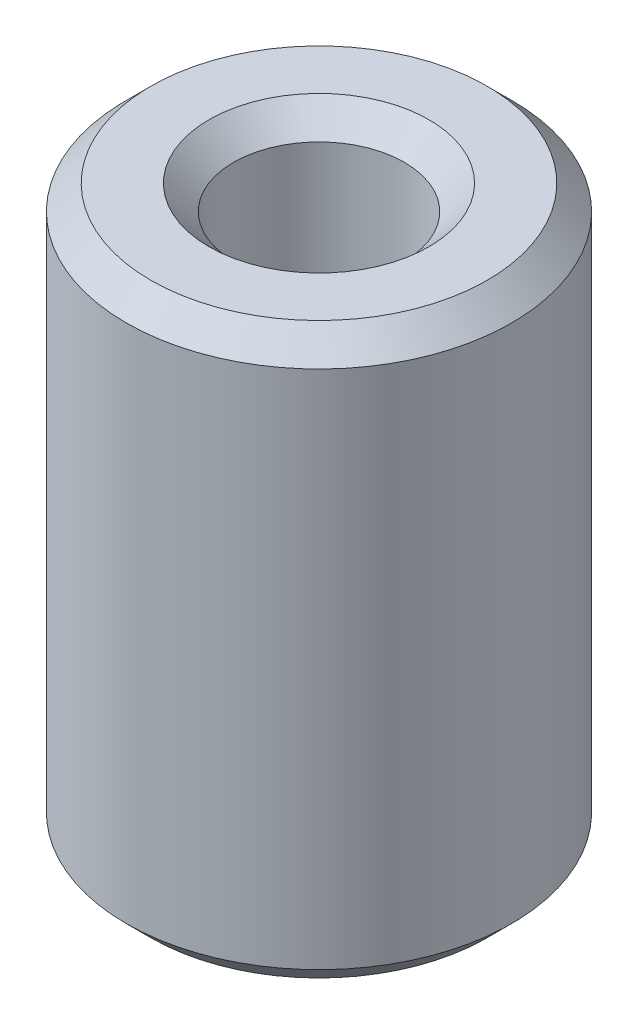
ISO-10303-21;
HEADER;
FILE_DESCRIPTION(('STEP AP214'),'2;1');
FILE_NAME('part.step','',(''),(''),'','','');
FILE_SCHEMA(('AUTOMOTIVE_DESIGN { 1 0 10303 214 1 1 1 1 }'));
ENDSEC;
DATA;
#1=APPLICATION_CONTEXT('core data for automotive mechanical design processes');
#2=APPLICATION_PROTOCOL_DEFINITION('international standard','automotive_design',2000,#1);
#3=PRODUCT_CONTEXT('',#1,'mechanical');
#4=PRODUCT('Part','Part','',(#3));
#5=PRODUCT_RELATED_PRODUCT_CATEGORY('part','',(#4));
#6=PRODUCT_DEFINITION_FORMATION('','',#4);
#7=PRODUCT_DEFINITION_CONTEXT('part definition',#1,'design');
#8=PRODUCT_DEFINITION('design','',#6,#7);
#9=PRODUCT_DEFINITION_SHAPE('','',#8);
#10=(LENGTH_UNIT() NAMED_UNIT(*) SI_UNIT(.MILLI.,.METRE.));
#11=(NAMED_UNIT(*) PLANE_ANGLE_UNIT() SI_UNIT($,.RADIAN.));
#12=(NAMED_UNIT(*) SI_UNIT($,.STERADIAN.) SOLID_ANGLE_UNIT());
#13=UNCERTAINTY_MEASURE_WITH_UNIT(LENGTH_MEASURE(1.E-05),#10,'distance_accuracy_value','');
#14=(GEOMETRIC_REPRESENTATION_CONTEXT(3) GLOBAL_UNCERTAINTY_ASSIGNED_CONTEXT((#13)) GLOBAL_UNIT_ASSIGNED_CONTEXT((#10,
#11,#12)) REPRESENTATION_CONTEXT('',''));
#15=CARTESIAN_POINT('',(0.,0.,0.));
#16=DIRECTION('',(0.,0.,1.));
#17=DIRECTION('',(1.,0.,0.));
#18=AXIS2_PLACEMENT_3D('',#15,#16,#17);
#19=CARTESIAN_POINT('',(0.,81.2302246455792,0.));
#20=DIRECTION('',(0.,-1.,0.));
#21=DIRECTION('',(0.,0.,-1.));
#22=AXIS2_PLACEMENT_3D('',#19,#20,#21);
#23=CYLINDRICAL_SURFACE('',#22,27.5);
#24=CARTESIAN_POINT('',(0.,3.50983312041056,0.));
#25=DIRECTION('',(0.,1.,0.));
#26=DIRECTION('',(0.,0.,1.));
#27=AXIS2_PLACEMENT_3D('',#24,#25,#26);
#28=CIRCLE('',#27,27.5);
#29=CARTESIAN_POINT('',(0.,3.50983312041056,27.5));
#30=VERTEX_POINT('',#29);
#31=EDGE_CURVE('E10',#30,#30,#28,.T.);
#32=ORIENTED_EDGE('',*,*,#31,.T.);
#33=EDGE_LOOP('',(#32));
#34=FACE_BOUND('',#33,.T.);
#35=CARTESIAN_POINT('',(0.,77.7203915251686,0.));
#36=DIRECTION('',(0.,1.,0.));
#37=DIRECTION('',(0.,0.,1.));
#38=AXIS2_PLACEMENT_3D('',#35,#36,#37);
#39=CIRCLE('',#38,27.5);
#40=CARTESIAN_POINT('',(0.,77.7203915251686,27.5));
#41=VERTEX_POINT('',#40);
#42=EDGE_CURVE('E50',#41,#41,#39,.F.);
#43=ORIENTED_EDGE('',*,*,#42,.T.);
#44=EDGE_LOOP('',(#43));
#45=FACE_BOUND('',#44,.T.);
#46=ADVANCED_FACE('F39',(#34,#45),#23,.T.);
#47=CARTESIAN_POINT('',(0.,81.2302246455792,0.));
#48=DIRECTION('',(0.,1.,0.));
#49=DIRECTION('',(0.,0.,1.));
#50=AXIS2_PLACEMENT_3D('',#47,#48,#49);
#51=PLANE('',#50);
#52=CARTESIAN_POINT('',(0.,81.2302246455792,0.));
#53=DIRECTION('',(0.,1.,0.));
#54=DIRECTION('',(0.,0.,1.));
#55=AXIS2_PLACEMENT_3D('',#52,#53,#54);
#56=CIRCLE('',#55,15.6962505107457);
#57=CARTESIAN_POINT('',(0.,81.2302246455792,15.6962505107457));
#58=VERTEX_POINT('',#57);
#59=EDGE_CURVE('E58',#58,#58,#56,.F.);
#60=ORIENTED_EDGE('',*,*,#59,.T.);
#61=EDGE_LOOP('',(#60));
#62=FACE_BOUND('',#61,.T.);
#63=CARTESIAN_POINT('',(0.,81.2302246455792,0.));
#64=DIRECTION('',(0.,1.,0.));
#65=DIRECTION('',(0.,0.,1.));
#66=AXIS2_PLACEMENT_3D('',#63,#64,#65);
#67=CIRCLE('',#66,23.9901668795894);
#68=CARTESIAN_POINT('',(0.,81.2302246455792,23.9901668795894));
#69=VERTEX_POINT('',#68);
#70=EDGE_CURVE('E61',#69,#69,#67,.T.);
#71=ORIENTED_EDGE('',*,*,#70,.T.);
#72=EDGE_LOOP('',(#71));
#73=FACE_BOUND('',#72,.T.);
#74=ADVANCED_FACE('F88',(#62,#73),#51,.T.);
#75=CARTESIAN_POINT('',(0.,0.,0.));
#76=DIRECTION('',(0.,1.,0.));
#77=DIRECTION('',(0.,0.,1.));
#78=AXIS2_PLACEMENT_3D('',#75,#76,#77);
#79=PLANE('',#78);
#80=CARTESIAN_POINT('',(0.,0.,0.));
#81=DIRECTION('',(0.,1.,0.));
#82=DIRECTION('',(0.,0.,1.));
#83=AXIS2_PLACEMENT_3D('',#80,#81,#82);
#84=CIRCLE('',#83,15.6962505107457);
#85=CARTESIAN_POINT('',(0.,0.,15.6962505107457));
#86=VERTEX_POINT('',#85);
#87=EDGE_CURVE('E51',#86,#86,#84,.T.);
#88=ORIENTED_EDGE('',*,*,#87,.T.);
#89=EDGE_LOOP('',(#88));
#90=FACE_BOUND('',#89,.T.);
#91=CARTESIAN_POINT('',(0.,0.,0.));
#92=DIRECTION('',(0.,1.,0.));
#93=DIRECTION('',(0.,0.,1.));
#94=AXIS2_PLACEMENT_3D('',#91,#92,#93);
#95=CIRCLE('',#94,23.9901668795894);
#96=CARTESIAN_POINT('',(0.,0.,23.9901668795894));
#97=VERTEX_POINT('',#96);
#98=EDGE_CURVE('E54',#97,#97,#95,.F.);
#99=ORIENTED_EDGE('',*,*,#98,.T.);
#100=EDGE_LOOP('',(#99));
#101=FACE_BOUND('',#100,.T.);
#102=ADVANCED_FACE('F83',(#90,#101),#79,.F.);
#103=CARTESIAN_POINT('',(0.,81.2302246455792,0.));
#104=DIRECTION('',(0.,-1.,0.));
#105=DIRECTION('',(0.,0.,-1.));
#106=AXIS2_PLACEMENT_3D('',#103,#104,#105);
#107=CYLINDRICAL_SURFACE('',#106,12.1864173903351);
#108=CARTESIAN_POINT('',(0.,77.7203915251687,0.));
#109=DIRECTION('',(0.,1.,0.));
#110=DIRECTION('',(0.,0.,1.));
#111=AXIS2_PLACEMENT_3D('',#108,#109,#110);
#112=CIRCLE('',#111,12.1864173903351);
#113=CARTESIAN_POINT('',(0.,77.7203915251687,12.1864173903351));
#114=VERTEX_POINT('',#113);
#115=EDGE_CURVE('E67',#114,#114,#112,.T.);
#116=ORIENTED_EDGE('',*,*,#115,.T.);
#117=EDGE_LOOP('',(#116));
#118=FACE_BOUND('',#117,.T.);
#119=CARTESIAN_POINT('',(0.,3.50983312041062,0.));
#120=DIRECTION('',(0.,1.,0.));
#121=DIRECTION('',(0.,0.,1.));
#122=AXIS2_PLACEMENT_3D('',#119,#120,#121);
#123=CIRCLE('',#122,12.1864173903351);
#124=CARTESIAN_POINT('',(0.,3.50983312041062,12.1864173903351));
#125=VERTEX_POINT('',#124);
#126=EDGE_CURVE('E69',#125,#125,#123,.F.);
#127=ORIENTED_EDGE('',*,*,#126,.T.);
#128=EDGE_LOOP('',(#127));
#129=FACE_BOUND('',#128,.T.);
#130=ADVANCED_FACE('F71',(#118,#129),#107,.F.);
#131=CARTESIAN_POINT('',(0.,77.7203915251687,0.));
#132=DIRECTION('',(0.,1.,0.));
#133=DIRECTION('',(0.,0.,1.));
#134=AXIS2_PLACEMENT_3D('',#131,#132,#133);
#135=CONICAL_SURFACE('',#134,12.1864173903351,0.785398163397453);
#136=ORIENTED_EDGE('',*,*,#59,.F.);
#137=EDGE_LOOP('',(#136));
#138=FACE_BOUND('',#137,.T.);
#139=ORIENTED_EDGE('',*,*,#115,.F.);
#140=EDGE_LOOP('',(#139));
#141=FACE_BOUND('',#140,.T.);
#142=ADVANCED_FACE('F77',(#138,#141),#135,.F.);
#143=CARTESIAN_POINT('',(0.,0.,0.));
#144=DIRECTION('',(0.,-1.,0.));
#145=DIRECTION('',(0.,0.,-1.));
#146=AXIS2_PLACEMENT_3D('',#143,#144,#145);
#147=CONICAL_SURFACE('',#146,15.6962505107457,0.785398163397447);
#148=ORIENTED_EDGE('',*,*,#126,.F.);
#149=EDGE_LOOP('',(#148));
#150=FACE_BOUND('',#149,.T.);
#151=ORIENTED_EDGE('',*,*,#87,.F.);
#152=EDGE_LOOP('',(#151));
#153=FACE_BOUND('',#152,.T.);
#154=ADVANCED_FACE('F73',(#150,#153),#147,.F.);
#155=CARTESIAN_POINT('',(0.,3.50983312041056,0.));
#156=DIRECTION('',(0.,1.,0.));
#157=DIRECTION('',(0.,0.,1.));
#158=AXIS2_PLACEMENT_3D('',#155,#156,#157);
#159=CONICAL_SURFACE('',#158,27.5,0.785398163397453);
#160=ORIENTED_EDGE('',*,*,#98,.F.);
#161=EDGE_LOOP('',(#160));
#162=FACE_BOUND('',#161,.T.);
#163=ORIENTED_EDGE('',*,*,#31,.F.);
#164=EDGE_LOOP('',(#163));
#165=FACE_BOUND('',#164,.T.);
#166=ADVANCED_FACE('F76',(#162,#165),#159,.T.);
#167=CARTESIAN_POINT('',(0.,81.2302246455792,0.));
#168=DIRECTION('',(0.,-1.,0.));
#169=DIRECTION('',(0.,0.,-1.));
#170=AXIS2_PLACEMENT_3D('',#167,#168,#169);
#171=CONICAL_SURFACE('',#170,23.9901668795894,0.785398163397443);
#172=ORIENTED_EDGE('',*,*,#42,.F.);
#173=EDGE_LOOP('',(#172));
#174=FACE_BOUND('',#173,.T.);
#175=ORIENTED_EDGE('',*,*,#70,.F.);
#176=EDGE_LOOP('',(#175));
#177=FACE_BOUND('',#176,.T.);
#178=ADVANCED_FACE('F45',(#174,#177),#171,.T.);
#179=CLOSED_SHELL('',(#46,#74,#102,#130,#142,#154,#166,#178));
#180=MANIFOLD_SOLID_BREP('B2',#179);
#181=ADVANCED_BREP_SHAPE_REPRESENTATION('',(#18,#180),#14);
#182=SHAPE_DEFINITION_REPRESENTATION(#9,#181);
ENDSEC;
END-ISO-10303-21;
